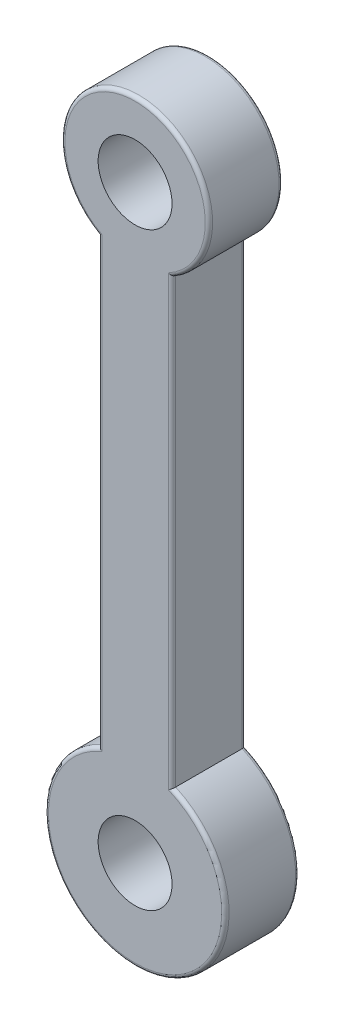
ISO-10303-21;
HEADER;
FILE_DESCRIPTION(('STEP AP214'),'2;1');
FILE_NAME('part.step','',(''),(''),'','','');
FILE_SCHEMA(('AUTOMOTIVE_DESIGN { 1 0 10303 214 1 1 1 1 }'));
ENDSEC;
DATA;
#1=APPLICATION_CONTEXT('core data for automotive mechanical design processes');
#2=APPLICATION_PROTOCOL_DEFINITION('international standard','automotive_design',2000,#1);
#3=PRODUCT_CONTEXT('',#1,'mechanical');
#4=PRODUCT('Part','Part','',(#3));
#5=PRODUCT_RELATED_PRODUCT_CATEGORY('part','',(#4));
#6=PRODUCT_DEFINITION_FORMATION('','',#4);
#7=PRODUCT_DEFINITION_CONTEXT('part definition',#1,'design');
#8=PRODUCT_DEFINITION('design','',#6,#7);
#9=PRODUCT_DEFINITION_SHAPE('','',#8);
#10=(LENGTH_UNIT() NAMED_UNIT(*) SI_UNIT(.MILLI.,.METRE.));
#11=(NAMED_UNIT(*) PLANE_ANGLE_UNIT() SI_UNIT($,.RADIAN.));
#12=(NAMED_UNIT(*) SI_UNIT($,.STERADIAN.) SOLID_ANGLE_UNIT());
#13=UNCERTAINTY_MEASURE_WITH_UNIT(LENGTH_MEASURE(1.E-05),#10,'distance_accuracy_value','');
#14=(GEOMETRIC_REPRESENTATION_CONTEXT(3) GLOBAL_UNCERTAINTY_ASSIGNED_CONTEXT((#13)) GLOBAL_UNIT_ASSIGNED_CONTEXT((#10,
#11,#12)) REPRESENTATION_CONTEXT('',''));
#15=CARTESIAN_POINT('',(0.,0.,0.));
#16=DIRECTION('',(0.,0.,1.));
#17=DIRECTION('',(1.,0.,0.));
#18=AXIS2_PLACEMENT_3D('',#15,#16,#17);
#19=CARTESIAN_POINT('',(0.,0.,20.));
#20=DIRECTION('',(0.,0.,1.));
#21=DIRECTION('',(1.,0.,0.));
#22=AXIS2_PLACEMENT_3D('',#19,#20,#21);
#23=PLANE('',#22);
#24=DIRECTION('',(0.,-1.,0.));
#25=VECTOR('',#24,1.);
#26=CARTESIAN_POINT('',(-9.,-137.320508075689,20.));
#27=LINE('',#26,#25);
#28=CARTESIAN_POINT('',(-9.,-16.7332005306815,20.));
#29=VERTEX_POINT('',#28);
#30=CARTESIAN_POINT('',(-9.,-137.977945776719,20.));
#31=VERTEX_POINT('',#30);
#32=EDGE_CURVE('E132',#29,#31,#27,.T.);
#33=ORIENTED_EDGE('',*,*,#32,.T.);
#34=CARTESIAN_POINT('',(0.,-159.641016151378,20.));
#35=DIRECTION('',(0.,0.,1.));
#36=DIRECTION('',(1.,0.,0.));
#37=AXIS2_PLACEMENT_3D('',#34,#35,#36);
#38=CIRCLE('',#37,23.4582313497294);
#39=CARTESIAN_POINT('',(9.,-137.977945776719,20.));
#40=VERTEX_POINT('',#39);
#41=EDGE_CURVE('E113',#31,#40,#38,.T.);
#42=ORIENTED_EDGE('',*,*,#41,.T.);
#43=DIRECTION('',(0.,1.,0.));
#44=VECTOR('',#43,1.);
#45=CARTESIAN_POINT('',(9.,-17.3205080756888,20.));
#46=LINE('',#45,#44);
#47=CARTESIAN_POINT('',(9.,-16.7332005306815,20.));
#48=VERTEX_POINT('',#47);
#49=EDGE_CURVE('E121',#40,#48,#46,.T.);
#50=ORIENTED_EDGE('',*,*,#49,.T.);
#51=CARTESIAN_POINT('',(0.,0.,20.));
#52=DIRECTION('',(0.,0.,1.));
#53=DIRECTION('',(1.,0.,0.));
#54=AXIS2_PLACEMENT_3D('',#51,#52,#53);
#55=CIRCLE('',#54,19.);
#56=EDGE_CURVE('E127',#48,#29,#55,.T.);
#57=ORIENTED_EDGE('',*,*,#56,.T.);
#58=EDGE_LOOP('',(#33,#42,#50,#57));
#59=FACE_BOUND('',#58,.T.);
#60=CARTESIAN_POINT('',(0.,0.,20.));
#61=DIRECTION('',(0.,0.,1.));
#62=DIRECTION('',(1.,0.,0.));
#63=AXIS2_PLACEMENT_3D('',#60,#61,#62);
#64=CIRCLE('',#63,10.);
#65=CARTESIAN_POINT('',(10.,0.,20.));
#66=VERTEX_POINT('',#65);
#67=EDGE_CURVE('E249',#66,#66,#64,.T.);
#68=ORIENTED_EDGE('',*,*,#67,.F.);
#69=EDGE_LOOP('',(#68));
#70=FACE_BOUND('',#69,.T.);
#71=CARTESIAN_POINT('',(0.,-159.641016151378,20.));
#72=DIRECTION('',(0.,0.,1.));
#73=DIRECTION('',(1.,0.,0.));
#74=AXIS2_PLACEMENT_3D('',#71,#72,#73);
#75=CIRCLE('',#74,10.);
#76=CARTESIAN_POINT('',(10.,-159.641016151378,20.));
#77=VERTEX_POINT('',#76);
#78=EDGE_CURVE('E299',#77,#77,#75,.T.);
#79=ORIENTED_EDGE('',*,*,#78,.F.);
#80=EDGE_LOOP('',(#79));
#81=FACE_BOUND('',#80,.T.);
#82=ADVANCED_FACE('F36',(#59,#70,#81),#23,.T.);
#83=CARTESIAN_POINT('',(0.,0.,0.));
#84=DIRECTION('',(0.,0.,1.));
#85=DIRECTION('',(1.,0.,0.));
#86=AXIS2_PLACEMENT_3D('',#83,#84,#85);
#87=PLANE('',#86);
#88=CARTESIAN_POINT('',(0.,0.,0.));
#89=DIRECTION('',(0.,0.,1.));
#90=DIRECTION('',(1.,0.,0.));
#91=AXIS2_PLACEMENT_3D('',#88,#89,#90);
#92=CIRCLE('',#91,19.);
#93=CARTESIAN_POINT('',(-9.,-16.7332005306815,0.));
#94=VERTEX_POINT('',#93);
#95=CARTESIAN_POINT('',(9.,-16.7332005306815,0.));
#96=VERTEX_POINT('',#95);
#97=EDGE_CURVE('E154',#94,#96,#92,.F.);
#98=ORIENTED_EDGE('',*,*,#97,.T.);
#99=DIRECTION('',(0.,1.,0.));
#100=VECTOR('',#99,1.);
#101=CARTESIAN_POINT('',(9.,0.,0.));
#102=LINE('',#101,#100);
#103=CARTESIAN_POINT('',(9.,-137.977945776719,0.));
#104=VERTEX_POINT('',#103);
#105=EDGE_CURVE('E11',#96,#104,#102,.F.);
#106=ORIENTED_EDGE('',*,*,#105,.T.);
#107=CARTESIAN_POINT('',(0.,-159.641016151378,0.));
#108=DIRECTION('',(0.,0.,1.));
#109=DIRECTION('',(1.,0.,0.));
#110=AXIS2_PLACEMENT_3D('',#107,#108,#109);
#111=CIRCLE('',#110,23.4582313497294);
#112=CARTESIAN_POINT('',(-9.,-137.977945776719,0.));
#113=VERTEX_POINT('',#112);
#114=EDGE_CURVE('E50',#104,#113,#111,.F.);
#115=ORIENTED_EDGE('',*,*,#114,.T.);
#116=DIRECTION('',(0.,-1.,0.));
#117=VECTOR('',#116,1.);
#118=CARTESIAN_POINT('',(-9.,0.,0.));
#119=LINE('',#118,#117);
#120=EDGE_CURVE('E156',#113,#94,#119,.F.);
#121=ORIENTED_EDGE('',*,*,#120,.T.);
#122=EDGE_LOOP('',(#98,#106,#115,#121));
#123=FACE_BOUND('',#122,.T.);
#124=CARTESIAN_POINT('',(0.,0.,0.));
#125=DIRECTION('',(0.,0.,1.));
#126=DIRECTION('',(1.,0.,0.));
#127=AXIS2_PLACEMENT_3D('',#124,#125,#126);
#128=CIRCLE('',#127,10.);
#129=CARTESIAN_POINT('',(10.,0.,0.));
#130=VERTEX_POINT('',#129);
#131=EDGE_CURVE('E254',#130,#130,#128,.T.);
#132=ORIENTED_EDGE('',*,*,#131,.T.);
#133=EDGE_LOOP('',(#132));
#134=FACE_BOUND('',#133,.T.);
#135=CARTESIAN_POINT('',(0.,-159.641016151378,0.));
#136=DIRECTION('',(0.,0.,1.));
#137=DIRECTION('',(1.,0.,0.));
#138=AXIS2_PLACEMENT_3D('',#135,#136,#137);
#139=CIRCLE('',#138,10.);
#140=CARTESIAN_POINT('',(10.,-159.641016151378,0.));
#141=VERTEX_POINT('',#140);
#142=EDGE_CURVE('E193',#141,#141,#139,.T.);
#143=ORIENTED_EDGE('',*,*,#142,.T.);
#144=EDGE_LOOP('',(#143));
#145=FACE_BOUND('',#144,.T.);
#146=ADVANCED_FACE('F233',(#123,#134,#145),#87,.F.);
#147=CARTESIAN_POINT('',(0.,0.,20.));
#148=DIRECTION('',(0.,0.,-1.));
#149=DIRECTION('',(-1.,0.,0.));
#150=AXIS2_PLACEMENT_3D('',#147,#148,#149);
#151=CYLINDRICAL_SURFACE('',#150,20.);
#152=DIRECTION('',(0.,0.,-1.));
#153=VECTOR('',#152,1.);
#154=CARTESIAN_POINT('',(-10.,-17.3205080756888,20.));
#155=LINE('',#154,#153);
#156=CARTESIAN_POINT('',(-10.,-17.3205080756888,19.));
#157=VERTEX_POINT('',#156);
#158=CARTESIAN_POINT('',(-10.,-17.3205080756888,0.999999999999997));
#159=VERTEX_POINT('',#158);
#160=EDGE_CURVE('E128',#157,#159,#155,.T.);
#161=ORIENTED_EDGE('',*,*,#160,.F.);
#162=CARTESIAN_POINT('',(0.,0.,19.));
#163=DIRECTION('',(0.,0.,1.));
#164=DIRECTION('',(1.,0.,0.));
#165=AXIS2_PLACEMENT_3D('',#162,#163,#164);
#166=CIRCLE('',#165,20.);
#167=CARTESIAN_POINT('',(10.,-17.3205080756888,19.));
#168=VERTEX_POINT('',#167);
#169=EDGE_CURVE('E147',#157,#168,#166,.F.);
#170=ORIENTED_EDGE('',*,*,#169,.T.);
#171=DIRECTION('',(0.,0.,-1.));
#172=VECTOR('',#171,1.);
#173=CARTESIAN_POINT('',(10.,-17.3205080756888,20.));
#174=LINE('',#173,#172);
#175=CARTESIAN_POINT('',(10.,-17.3205080756888,0.999999999999997));
#176=VERTEX_POINT('',#175);
#177=EDGE_CURVE('E244',#168,#176,#174,.T.);
#178=ORIENTED_EDGE('',*,*,#177,.T.);
#179=CARTESIAN_POINT('',(0.,0.,1.));
#180=DIRECTION('',(0.,0.,1.));
#181=DIRECTION('',(1.,0.,0.));
#182=AXIS2_PLACEMENT_3D('',#179,#180,#181);
#183=CIRCLE('',#182,20.);
#184=EDGE_CURVE('E145',#176,#159,#183,.T.);
#185=ORIENTED_EDGE('',*,*,#184,.T.);
#186=EDGE_LOOP('',(#161,#170,#178,#185));
#187=FACE_BOUND('',#186,.T.);
#188=ADVANCED_FACE('F247',(#187),#151,.T.);
#189=CARTESIAN_POINT('',(-10.,-17.3205080756888,20.));
#190=DIRECTION('',(1.,0.,0.));
#191=DIRECTION('',(0.,0.,-1.));
#192=AXIS2_PLACEMENT_3D('',#189,#190,#191);
#193=PLANE('',#192);
#194=DIRECTION('',(0.,0.,-1.));
#195=VECTOR('',#194,1.);
#196=CARTESIAN_POINT('',(-10.,-137.320508075689,20.));
#197=LINE('',#196,#195);
#198=CARTESIAN_POINT('',(-10.,-137.320508075689,19.));
#199=VERTEX_POINT('',#198);
#200=CARTESIAN_POINT('',(-10.,-137.320508075689,0.999999999999997));
#201=VERTEX_POINT('',#200);
#202=EDGE_CURVE('E251',#199,#201,#197,.T.);
#203=ORIENTED_EDGE('',*,*,#202,.F.);
#204=DIRECTION('',(0.,-1.,0.));
#205=VECTOR('',#204,1.);
#206=CARTESIAN_POINT('',(-10.,-17.3205080756888,19.));
#207=LINE('',#206,#205);
#208=EDGE_CURVE('E143',#199,#157,#207,.F.);
#209=ORIENTED_EDGE('',*,*,#208,.T.);
#210=ORIENTED_EDGE('',*,*,#160,.T.);
#211=DIRECTION('',(0.,-1.,0.));
#212=VECTOR('',#211,1.);
#213=CARTESIAN_POINT('',(-10.,-17.3205080756888,1.));
#214=LINE('',#213,#212);
#215=EDGE_CURVE('E141',#159,#201,#214,.T.);
#216=ORIENTED_EDGE('',*,*,#215,.T.);
#217=EDGE_LOOP('',(#203,#209,#210,#216));
#218=FACE_BOUND('',#217,.T.);
#219=ADVANCED_FACE('F267',(#218),#193,.F.);
#220=CARTESIAN_POINT('',(0.,-159.641016151378,20.));
#221=DIRECTION('',(0.,0.,-1.));
#222=DIRECTION('',(-1.,0.,0.));
#223=AXIS2_PLACEMENT_3D('',#220,#221,#222);
#224=CYLINDRICAL_SURFACE('',#223,24.4582313497294);
#225=DIRECTION('',(0.,0.,-1.));
#226=VECTOR('',#225,1.);
#227=CARTESIAN_POINT('',(10.,-137.320508075689,20.));
#228=LINE('',#227,#226);
#229=CARTESIAN_POINT('',(10.,-137.320508075689,19.));
#230=VERTEX_POINT('',#229);
#231=CARTESIAN_POINT('',(10.,-137.320508075689,0.999999999999997));
#232=VERTEX_POINT('',#231);
#233=EDGE_CURVE('E246',#230,#232,#228,.T.);
#234=ORIENTED_EDGE('',*,*,#233,.F.);
#235=CARTESIAN_POINT('',(0.,-159.641016151378,19.));
#236=DIRECTION('',(0.,0.,1.));
#237=DIRECTION('',(1.,0.,0.));
#238=AXIS2_PLACEMENT_3D('',#235,#236,#237);
#239=CIRCLE('',#238,24.4582313497294);
#240=EDGE_CURVE('E115',#230,#199,#239,.F.);
#241=ORIENTED_EDGE('',*,*,#240,.T.);
#242=ORIENTED_EDGE('',*,*,#202,.T.);
#243=CARTESIAN_POINT('',(0.,-159.641016151378,1.));
#244=DIRECTION('',(0.,0.,1.));
#245=DIRECTION('',(1.,0.,0.));
#246=AXIS2_PLACEMENT_3D('',#243,#244,#245);
#247=CIRCLE('',#246,24.4582313497294);
#248=EDGE_CURVE('E134',#201,#232,#247,.T.);
#249=ORIENTED_EDGE('',*,*,#248,.T.);
#250=EDGE_LOOP('',(#234,#241,#242,#249));
#251=FACE_BOUND('',#250,.T.);
#252=ADVANCED_FACE('F266',(#251),#224,.T.);
#253=CARTESIAN_POINT('',(10.,-17.3205080756888,20.));
#254=DIRECTION('',(-1.,0.,0.));
#255=DIRECTION('',(0.,0.,1.));
#256=AXIS2_PLACEMENT_3D('',#253,#254,#255);
#257=PLANE('',#256);
#258=ORIENTED_EDGE('',*,*,#177,.F.);
#259=DIRECTION('',(0.,1.,0.));
#260=VECTOR('',#259,1.);
#261=CARTESIAN_POINT('',(10.,-137.320508075689,19.));
#262=LINE('',#261,#260);
#263=EDGE_CURVE('E152',#168,#230,#262,.F.);
#264=ORIENTED_EDGE('',*,*,#263,.T.);
#265=ORIENTED_EDGE('',*,*,#233,.T.);
#266=DIRECTION('',(0.,1.,0.));
#267=VECTOR('',#266,1.);
#268=CARTESIAN_POINT('',(10.,-17.3205080756888,1.));
#269=LINE('',#268,#267);
#270=EDGE_CURVE('E149',#232,#176,#269,.T.);
#271=ORIENTED_EDGE('',*,*,#270,.T.);
#272=EDGE_LOOP('',(#258,#264,#265,#271));
#273=FACE_BOUND('',#272,.T.);
#274=ADVANCED_FACE('F243',(#273),#257,.F.);
#275=CARTESIAN_POINT('',(0.,0.,20.));
#276=DIRECTION('',(0.,0.,-1.));
#277=DIRECTION('',(-1.,0.,0.));
#278=AXIS2_PLACEMENT_3D('',#275,#276,#277);
#279=CYLINDRICAL_SURFACE('',#278,10.);
#280=ORIENTED_EDGE('',*,*,#67,.T.);
#281=EDGE_LOOP('',(#280));
#282=FACE_BOUND('',#281,.T.);
#283=ORIENTED_EDGE('',*,*,#131,.F.);
#284=EDGE_LOOP('',(#283));
#285=FACE_BOUND('',#284,.T.);
#286=ADVANCED_FACE('F282',(#282,#285),#279,.F.);
#287=CARTESIAN_POINT('',(0.,-159.641016151378,20.));
#288=DIRECTION('',(0.,0.,-1.));
#289=DIRECTION('',(-1.,0.,0.));
#290=AXIS2_PLACEMENT_3D('',#287,#288,#289);
#291=CYLINDRICAL_SURFACE('',#290,10.);
#292=ORIENTED_EDGE('',*,*,#78,.T.);
#293=EDGE_LOOP('',(#292));
#294=FACE_BOUND('',#293,.T.);
#295=ORIENTED_EDGE('',*,*,#142,.F.);
#296=EDGE_LOOP('',(#295));
#297=FACE_BOUND('',#296,.T.);
#298=ADVANCED_FACE('F289',(#294,#297),#291,.F.);
#299=CARTESIAN_POINT('',(0.,0.,19.));
#300=DIRECTION('',(0.,0.,1.));
#301=DIRECTION('',(1.,0.,0.));
#302=AXIS2_PLACEMENT_3D('',#299,#300,#301);
#303=TOROIDAL_SURFACE('',#302,19.,1.);
#304=CARTESIAN_POINT('',(10.,-17.3205080756888,19.));
#305=CARTESIAN_POINT('',(10.0000015213787,-17.3205088649879,19.0254213694073));
#306=CARTESIAN_POINT('',(9.9990298908973,-17.3199479917732,19.0508294576426));
#307=CARTESIAN_POINT('',(9.99516504436778,-17.3177164417791,19.1014418799058));
#308=CARTESIAN_POINT('',(9.99227245124936,-17.3160461247702,19.1266462773057));
#309=CARTESIAN_POINT('',(9.98078809503932,-17.3094131179025,19.2014605330454));
#310=CARTESIAN_POINT('',(9.96938918157886,-17.3028280552472,19.2505313542434));
#311=CARTESIAN_POINT('',(9.93967240320598,-17.2856449291653,19.3456933166742));
#312=CARTESIAN_POINT('',(9.92136026994311,-17.2750501900846,19.391786889327));
#313=CARTESIAN_POINT('',(9.87861920031722,-17.2502909209951,19.480035288383));
#314=CARTESIAN_POINT('',(9.85418534373633,-17.2361235194671,19.5221869089135));
#315=CARTESIAN_POINT('',(9.79876970962982,-17.2039433022038,19.6037551827543));
#316=CARTESIAN_POINT('',(9.76751932861995,-17.1857722779364,19.6429258012997));
#317=CARTESIAN_POINT('',(9.70039220690246,-17.1466680871438,19.7154687382402));
#318=CARTESIAN_POINT('',(9.66451432931181,-17.1257342418196,19.7488396270128));
#319=CARTESIAN_POINT('',(9.58435755500454,-17.0788689993086,19.8133244345145));
#320=CARTESIAN_POINT('',(9.53959033522715,-17.0526405245776,19.8436145075656));
#321=CARTESIAN_POINT('',(9.44673922114586,-16.9981037001412,19.8962573307227));
#322=CARTESIAN_POINT('',(9.39865179544903,-16.9697931337577,19.9186014692109));
#323=CARTESIAN_POINT('',(9.2939250511975,-16.9079737334143,19.9576672613025));
#324=CARTESIAN_POINT('',(9.23698803401073,-16.8742683233141,19.9732764258468));
#325=CARTESIAN_POINT('',(9.12192232680775,-16.8059397288755,19.9942558815965));
#326=CARTESIAN_POINT('',(9.0637963634934,-16.7713186005823,19.999647414163));
#327=CARTESIAN_POINT('',(9.00385664538732,-16.7355051991757,19.9999944308194));
#328=CARTESIAN_POINT('',(9.00192824516759,-16.7343528787191,20.0000000085153));
#329=CARTESIAN_POINT('',(9.,-16.7332005306815,20.));
#330=B_SPLINE_CURVE_WITH_KNOTS('',3,(#304,#305,#306,#307,#308,#309,#310,#311,#312,#313,#314,
#315,#316,#317,#318,#319,#320,#321,#322,#323,#324,#325,#326,#327,#328,#329),.UNSPECIFIED.,.F.,
.F.,(4,2,2,2,2,2,2,2,2,2,2,2,4),(0.,0.0762135177415197,0.1524023330285,0.304010944443037,
0.455494134438775,0.607099468929364,0.766370013796125,0.925679763039859,1.10520657890246,
1.28492737298502,1.48807392731624,1.69079769648834,1.69753705604942),.UNSPECIFIED.);
#331=EDGE_CURVE('E124',#168,#48,#330,.T.);
#332=ORIENTED_EDGE('',*,*,#331,.F.);
#333=ORIENTED_EDGE('',*,*,#169,.F.);
#334=CARTESIAN_POINT('',(-10.,-17.3205080756888,19.));
#335=CARTESIAN_POINT('',(-10.0000015213787,-17.3205088649879,19.0254213694073));
#336=CARTESIAN_POINT('',(-9.9990298908973,-17.3199479917732,19.0508294576426));
#337=CARTESIAN_POINT('',(-9.99516504436778,-17.3177164417791,19.1014418799058));
#338=CARTESIAN_POINT('',(-9.99227245124936,-17.3160461247702,19.1266462773057));
#339=CARTESIAN_POINT('',(-9.98078809503932,-17.3094131179025,19.2014605330454));
#340=CARTESIAN_POINT('',(-9.96938918157886,-17.3028280552472,19.2505313542434));
#341=CARTESIAN_POINT('',(-9.93967240320598,-17.2856449291653,19.3456933166742));
#342=CARTESIAN_POINT('',(-9.92136026994311,-17.2750501900846,19.391786889327));
#343=CARTESIAN_POINT('',(-9.87861920031722,-17.2502909209951,19.480035288383));
#344=CARTESIAN_POINT('',(-9.85418534373633,-17.2361235194671,19.5221869089135));
#345=CARTESIAN_POINT('',(-9.79876970962982,-17.2039433022038,19.6037551827543));
#346=CARTESIAN_POINT('',(-9.76751932861995,-17.1857722779364,19.6429258012997));
#347=CARTESIAN_POINT('',(-9.70039220690246,-17.1466680871438,19.7154687382402));
#348=CARTESIAN_POINT('',(-9.66451432931181,-17.1257342418196,19.7488396270128));
#349=CARTESIAN_POINT('',(-9.58435755500454,-17.0788689993086,19.8133244345145));
#350=CARTESIAN_POINT('',(-9.53959033522715,-17.0526405245776,19.8436145075656));
#351=CARTESIAN_POINT('',(-9.44673922114586,-16.9981037001412,19.8962573307227));
#352=CARTESIAN_POINT('',(-9.39865179544903,-16.9697931337577,19.9186014692109));
#353=CARTESIAN_POINT('',(-9.2939250511975,-16.9079737334143,19.9576672613025));
#354=CARTESIAN_POINT('',(-9.23698803401073,-16.8742683233141,19.9732764258468));
#355=CARTESIAN_POINT('',(-9.12192232680775,-16.8059397288755,19.9942558815965));
#356=CARTESIAN_POINT('',(-9.0637963634934,-16.7713186005823,19.999647414163));
#357=CARTESIAN_POINT('',(-9.00385664538732,-16.7355051991757,19.9999944308194));
#358=CARTESIAN_POINT('',(-9.00192824516759,-16.7343528787191,20.0000000085153));
#359=CARTESIAN_POINT('',(-9.,-16.7332005306815,20.));
#360=B_SPLINE_CURVE_WITH_KNOTS('',3,(#334,#335,#336,#337,#338,#339,#340,#341,#342,#343,#344,
#345,#346,#347,#348,#349,#350,#351,#352,#353,#354,#355,#356,#357,#358,#359),.UNSPECIFIED.,.F.,
.F.,(4,2,2,2,2,2,2,2,2,2,2,2,4),(0.,0.0762135177415197,0.1524023330285,0.304010944443037,
0.455494134438775,0.607099468929364,0.766370013796125,0.925679763039859,1.10520657890246,
1.28492737298502,1.48807392731624,1.69079769648834,1.69753705604942),.UNSPECIFIED.);
#361=EDGE_CURVE('E186',#29,#157,#360,.F.);
#362=ORIENTED_EDGE('',*,*,#361,.F.);
#363=ORIENTED_EDGE('',*,*,#56,.F.);
#364=EDGE_LOOP('',(#332,#333,#362,#363));
#365=FACE_BOUND('',#364,.T.);
#366=ADVANCED_FACE('F180',(#365),#303,.T.);
#367=CARTESIAN_POINT('',(-9.,0.,19.));
#368=DIRECTION('',(0.,1.,0.));
#369=DIRECTION('',(0.,0.,1.));
#370=AXIS2_PLACEMENT_3D('',#367,#368,#369);
#371=CYLINDRICAL_SURFACE('',#370,1.);
#372=ORIENTED_EDGE('',*,*,#361,.T.);
#373=ORIENTED_EDGE('',*,*,#208,.F.);
#374=CARTESIAN_POINT('',(-10.,-137.320508075689,19.));
#375=CARTESIAN_POINT('',(-10.000001799882,-137.320506990151,19.0248989787468));
#376=CARTESIAN_POINT('',(-9.99906932875468,-137.321110915363,19.0497846506509));
#377=CARTESIAN_POINT('',(-9.99536255969989,-137.323512156469,19.0993510007927));
#378=CARTESIAN_POINT('',(-9.99258897458729,-137.325309010503,19.1240317546246));
#379=CARTESIAN_POINT('',(-9.98158756030443,-137.332437491123,19.1972482859384));
#380=CARTESIAN_POINT('',(-9.97067837246651,-137.339507475066,19.2452465898575));
#381=CARTESIAN_POINT('',(-9.9423006680479,-137.357912612567,19.3382867689851));
#382=CARTESIAN_POINT('',(-9.92483943650304,-137.369243029098,19.3833318626821));
#383=CARTESIAN_POINT('',(-9.88417043991277,-137.395659924502,19.4695944364561));
#384=CARTESIAN_POINT('',(-9.86095687802403,-137.410750192407,19.5108079973811));
#385=CARTESIAN_POINT('',(-9.8082018710006,-137.445087061797,19.590970888278));
#386=CARTESIAN_POINT('',(-9.77836837489967,-137.464526034869,19.6296441312941));
#387=CARTESIAN_POINT('',(-9.71437338393335,-137.506287654426,19.7014163641255));
#388=CARTESIAN_POINT('',(-9.68021100848484,-137.528610887647,19.7345142165918));
#389=CARTESIAN_POINT('',(-9.60305227596163,-137.579114920227,19.7995282074503));
#390=CARTESIAN_POINT('',(-9.55950296480376,-137.607670000007,19.8304962618502));
#391=CARTESIAN_POINT('',(-9.4691764770102,-137.667021850803,19.884676795614));
#392=CARTESIAN_POINT('',(-9.42239508009534,-137.697821555717,19.9078788945732));
#393=CARTESIAN_POINT('',(-9.31507996941294,-137.76863281799,19.9512306349366));
#394=CARTESIAN_POINT('',(-9.25396781101131,-137.809063539766,19.969266916028));
#395=CARTESIAN_POINT('',(-9.13034756235588,-137.89108543345,19.993461216682));
#396=CARTESIAN_POINT('',(-9.0678425801236,-137.932674064952,19.9996434358544));
#397=CARTESIAN_POINT('',(-9.00364940973964,-137.975510212138,19.9999950105091));
#398=CARTESIAN_POINT('',(-9.00182463514341,-137.976727989075,20.0000000046921));
#399=CARTESIAN_POINT('',(-9.,-137.977945776719,20.));
#400=B_SPLINE_CURVE_WITH_KNOTS('',3,(#374,#375,#376,#377,#378,#379,#380,#381,#382,#383,#384,
#385,#386,#387,#388,#389,#390,#391,#392,#393,#394,#395,#396,#397,#398,#399),.UNSPECIFIED.,.F.,
.F.,(4,2,2,2,2,2,2,2,2,2,2,2,4),(0.,0.0746463806174724,0.149263877612207,0.297646167358094,
0.445863961473959,0.594231732124319,0.751333054340347,0.908466385655165,1.08953662851611,
1.27084794222994,1.4962375452077,1.72116653207475,1.72774793907547),.UNSPECIFIED.);
#401=EDGE_CURVE('E118',#31,#199,#400,.F.);
#402=ORIENTED_EDGE('',*,*,#401,.F.);
#403=ORIENTED_EDGE('',*,*,#32,.F.);
#404=EDGE_LOOP('',(#372,#373,#402,#403));
#405=FACE_BOUND('',#404,.T.);
#406=ADVANCED_FACE('F175',(#405),#371,.T.);
#407=CARTESIAN_POINT('',(9.,0.,19.));
#408=DIRECTION('',(0.,-1.,0.));
#409=DIRECTION('',(0.,0.,-1.));
#410=AXIS2_PLACEMENT_3D('',#407,#408,#409);
#411=CYLINDRICAL_SURFACE('',#410,1.);
#412=ORIENTED_EDGE('',*,*,#331,.T.);
#413=ORIENTED_EDGE('',*,*,#49,.F.);
#414=CARTESIAN_POINT('',(10.,-137.320508075689,19.));
#415=CARTESIAN_POINT('',(10.000001799882,-137.320506990151,19.0248989787468));
#416=CARTESIAN_POINT('',(9.99906932875468,-137.321110915363,19.0497846506509));
#417=CARTESIAN_POINT('',(9.99536255969989,-137.323512156469,19.0993510007927));
#418=CARTESIAN_POINT('',(9.99258897458729,-137.325309010503,19.1240317546246));
#419=CARTESIAN_POINT('',(9.98158756030443,-137.332437491123,19.1972482859384));
#420=CARTESIAN_POINT('',(9.97067837246651,-137.339507475066,19.2452465898575));
#421=CARTESIAN_POINT('',(9.9423006680479,-137.357912612567,19.3382867689851));
#422=CARTESIAN_POINT('',(9.92483943650304,-137.369243029098,19.3833318626821));
#423=CARTESIAN_POINT('',(9.88417043991277,-137.395659924502,19.4695944364561));
#424=CARTESIAN_POINT('',(9.86095687802403,-137.410750192407,19.5108079973811));
#425=CARTESIAN_POINT('',(9.8082018710006,-137.445087061797,19.590970888278));
#426=CARTESIAN_POINT('',(9.77836837489967,-137.464526034869,19.6296441312941));
#427=CARTESIAN_POINT('',(9.71437338393335,-137.506287654426,19.7014163641255));
#428=CARTESIAN_POINT('',(9.68021100848484,-137.528610887647,19.7345142165918));
#429=CARTESIAN_POINT('',(9.60305227596163,-137.579114920227,19.7995282074503));
#430=CARTESIAN_POINT('',(9.55950296480376,-137.607670000007,19.8304962618502));
#431=CARTESIAN_POINT('',(9.46917647701019,-137.667021850803,19.884676795614));
#432=CARTESIAN_POINT('',(9.42239508009533,-137.697821555717,19.9078788945732));
#433=CARTESIAN_POINT('',(9.31507996941294,-137.76863281799,19.9512306349366));
#434=CARTESIAN_POINT('',(9.25396781101131,-137.809063539766,19.969266916028));
#435=CARTESIAN_POINT('',(9.13034756235588,-137.89108543345,19.993461216682));
#436=CARTESIAN_POINT('',(9.0678425801236,-137.932674064952,19.9996434358544));
#437=CARTESIAN_POINT('',(9.00364940973964,-137.975510212138,19.9999950105091));
#438=CARTESIAN_POINT('',(9.00182463514341,-137.976727989075,20.0000000046921));
#439=CARTESIAN_POINT('',(9.,-137.977945776719,20.));
#440=B_SPLINE_CURVE_WITH_KNOTS('',3,(#414,#415,#416,#417,#418,#419,#420,#421,#422,#423,#424,
#425,#426,#427,#428,#429,#430,#431,#432,#433,#434,#435,#436,#437,#438,#439),.UNSPECIFIED.,.F.,
.F.,(4,2,2,2,2,2,2,2,2,2,2,2,4),(0.,0.074646380617469,0.149263877612207,0.297646167358094,
0.445863961473959,0.594231732124319,0.751333054340348,0.908466385655165,1.08953662851612,
1.27084794222994,1.4962375452077,1.72116653207475,1.72774793907547),.UNSPECIFIED.);
#441=EDGE_CURVE('E109',#230,#40,#440,.T.);
#442=ORIENTED_EDGE('',*,*,#441,.F.);
#443=ORIENTED_EDGE('',*,*,#263,.F.);
#444=EDGE_LOOP('',(#412,#413,#442,#443));
#445=FACE_BOUND('',#444,.T.);
#446=ADVANCED_FACE('F122',(#445),#411,.T.);
#447=CARTESIAN_POINT('',(0.,-159.641016151378,19.));
#448=DIRECTION('',(0.,0.,1.));
#449=DIRECTION('',(1.,0.,0.));
#450=AXIS2_PLACEMENT_3D('',#447,#448,#449);
#451=TOROIDAL_SURFACE('',#450,23.4582313497294,1.);
#452=ORIENTED_EDGE('',*,*,#401,.T.);
#453=ORIENTED_EDGE('',*,*,#240,.F.);
#454=ORIENTED_EDGE('',*,*,#441,.T.);
#455=ORIENTED_EDGE('',*,*,#41,.F.);
#456=EDGE_LOOP('',(#452,#453,#454,#455));
#457=FACE_BOUND('',#456,.T.);
#458=ADVANCED_FACE('F111',(#457),#451,.T.);
#459=CARTESIAN_POINT('',(-9.,-17.3205080756888,1.));
#460=DIRECTION('',(0.,-1.,0.));
#461=DIRECTION('',(0.,0.,-1.));
#462=AXIS2_PLACEMENT_3D('',#459,#460,#461);
#463=CYLINDRICAL_SURFACE('',#462,1.);
#464=CARTESIAN_POINT('',(-10.,-17.3205080756888,0.999999999999997));
#465=CARTESIAN_POINT('',(-10.0000015213787,-17.3205088649879,0.974578630592668));
#466=CARTESIAN_POINT('',(-9.9990298908973,-17.3199479917732,0.949170542357406));
#467=CARTESIAN_POINT('',(-9.99516504436778,-17.3177164417791,0.898558120094177));
#468=CARTESIAN_POINT('',(-9.99227245124936,-17.3160461247702,0.873353722694295));
#469=CARTESIAN_POINT('',(-9.98078809503932,-17.3094131179025,0.798539466954644));
#470=CARTESIAN_POINT('',(-9.96938918157886,-17.3028280552472,0.749468645756606));
#471=CARTESIAN_POINT('',(-9.93967240320598,-17.2856449291653,0.654306683325831));
#472=CARTESIAN_POINT('',(-9.92136026994311,-17.2750501900846,0.60821311067301));
#473=CARTESIAN_POINT('',(-9.87861920031722,-17.2502909209951,0.519964711616969));
#474=CARTESIAN_POINT('',(-9.85418534373633,-17.2361235194671,0.477813091086526));
#475=CARTESIAN_POINT('',(-9.79876970962982,-17.2039433022038,0.396244817245725));
#476=CARTESIAN_POINT('',(-9.76751932861995,-17.1857722779364,0.357074198700323));
#477=CARTESIAN_POINT('',(-9.70039220690246,-17.1466680871438,0.284531261759825));
#478=CARTESIAN_POINT('',(-9.66451432931181,-17.1257342418196,0.251160372987181));
#479=CARTESIAN_POINT('',(-9.58435755500453,-17.0788689993086,0.186675565485452));
#480=CARTESIAN_POINT('',(-9.53959033522714,-17.0526405245776,0.156385492434427));
#481=CARTESIAN_POINT('',(-9.44673922114586,-16.9981037001412,0.103742669277256));
#482=CARTESIAN_POINT('',(-9.39865179544903,-16.9697931337577,0.0813985307891217));
#483=CARTESIAN_POINT('',(-9.2939250511975,-16.9079737334143,0.0423327386974863));
#484=CARTESIAN_POINT('',(-9.23698803401073,-16.8742683233141,0.0267235741532206));
#485=CARTESIAN_POINT('',(-9.12192232680775,-16.8059397288755,0.00574411840347164));
#486=CARTESIAN_POINT('',(-9.0637963634934,-16.7713186005823,0.000352585836997369));
#487=CARTESIAN_POINT('',(-9.00385664538732,-16.7355051991757,5.56918058794224E-06));
#488=CARTESIAN_POINT('',(-9.00192824516759,-16.7343528787191,-8.51534430952261E-09));
#489=CARTESIAN_POINT('',(-9.,-16.7332005306815,0.));
#490=B_SPLINE_CURVE_WITH_KNOTS('',3,(#464,#465,#466,#467,#468,#469,#470,#471,#472,#473,#474,
#475,#476,#477,#478,#479,#480,#481,#482,#483,#484,#485,#486,#487,#488,#489),.UNSPECIFIED.,.F.,
.F.,(4,2,2,2,2,2,2,2,2,2,2,2,4),(0.,0.0762135177415199,0.152402333028498,0.304010944443036,
0.455494134438775,0.607099468929366,0.766370013796124,0.925679763039861,1.10520657890246,
1.28492737298502,1.48807392731625,1.69079769648834,1.69753705604942),.UNSPECIFIED.);
#491=EDGE_CURVE('E218',#94,#159,#490,.F.);
#492=ORIENTED_EDGE('',*,*,#491,.F.);
#493=ORIENTED_EDGE('',*,*,#120,.F.);
#494=CARTESIAN_POINT('',(-10.,-137.320508075689,0.999999999999997));
#495=CARTESIAN_POINT('',(-10.000001799882,-137.320506990151,0.975101021253209));
#496=CARTESIAN_POINT('',(-9.99906932875468,-137.321110915363,0.950215349349134));
#497=CARTESIAN_POINT('',(-9.99536255969989,-137.323512156469,0.900648999207316));
#498=CARTESIAN_POINT('',(-9.99258897458729,-137.325309010503,0.875968245375389));
#499=CARTESIAN_POINT('',(-9.98158756030443,-137.332437491123,0.802751714061625));
#500=CARTESIAN_POINT('',(-9.97067837246651,-137.339507475066,0.754753410142452));
#501=CARTESIAN_POINT('',(-9.9423006680479,-137.357912612567,0.66171323101486));
#502=CARTESIAN_POINT('',(-9.92483943650304,-137.369243029098,0.616668137317949));
#503=CARTESIAN_POINT('',(-9.88417043991277,-137.395659924502,0.530405563543864));
#504=CARTESIAN_POINT('',(-9.86095687802403,-137.410750192407,0.489192002618903));
#505=CARTESIAN_POINT('',(-9.8082018710006,-137.445087061797,0.409029111722025));
#506=CARTESIAN_POINT('',(-9.77836837489967,-137.464526034869,0.370355868705908));
#507=CARTESIAN_POINT('',(-9.71437338393334,-137.506287654426,0.298583635874449));
#508=CARTESIAN_POINT('',(-9.68021100848483,-137.528610887647,0.265485783408161));
#509=CARTESIAN_POINT('',(-9.60305227596162,-137.579114920227,0.200471792549676));
#510=CARTESIAN_POINT('',(-9.55950296480375,-137.607670000007,0.169503738149814));
#511=CARTESIAN_POINT('',(-9.46917647701019,-137.667021850803,0.115323204386019));
#512=CARTESIAN_POINT('',(-9.42239508009534,-137.697821555717,0.092121105426777));
#513=CARTESIAN_POINT('',(-9.31507996941295,-137.76863281799,0.0487693650634076));
#514=CARTESIAN_POINT('',(-9.25396781101132,-137.809063539766,0.0307330839720454));
#515=CARTESIAN_POINT('',(-9.13034756235589,-137.89108543345,0.00653878331802616));
#516=CARTESIAN_POINT('',(-9.06784258012361,-137.932674064952,0.000356564145599337));
#517=CARTESIAN_POINT('',(-9.00364940973964,-137.975510212138,4.98949090864816E-06));
#518=CARTESIAN_POINT('',(-9.00182463514341,-137.976727989075,-4.6920682636258E-09));
#519=CARTESIAN_POINT('',(-9.,-137.977945776719,0.));
#520=B_SPLINE_CURVE_WITH_KNOTS('',3,(#494,#495,#496,#497,#498,#499,#500,#501,#502,#503,#504,
#505,#506,#507,#508,#509,#510,#511,#512,#513,#514,#515,#516,#517,#518,#519),.UNSPECIFIED.,.F.,
.F.,(4,2,2,2,2,2,2,2,2,2,2,2,4),(0.,0.074646380617468,0.149263877612204,0.297646167358093,
0.445863961473959,0.59423173212432,0.751333054340352,0.908466385655175,1.08953662851612,
1.27084794222994,1.49623754520769,1.72116653207475,1.72774793907547),.UNSPECIFIED.);
#521=EDGE_CURVE('E41',#201,#113,#520,.T.);
#522=ORIENTED_EDGE('',*,*,#521,.F.);
#523=ORIENTED_EDGE('',*,*,#215,.F.);
#524=EDGE_LOOP('',(#492,#493,#522,#523));
#525=FACE_BOUND('',#524,.T.);
#526=ADVANCED_FACE('F38',(#525),#463,.T.);
#527=CARTESIAN_POINT('',(0.,-159.641016151378,1.));
#528=DIRECTION('',(0.,0.,1.));
#529=DIRECTION('',(1.,0.,0.));
#530=AXIS2_PLACEMENT_3D('',#527,#528,#529);
#531=TOROIDAL_SURFACE('',#530,23.4582313497294,1.);
#532=ORIENTED_EDGE('',*,*,#521,.T.);
#533=ORIENTED_EDGE('',*,*,#114,.F.);
#534=CARTESIAN_POINT('',(10.,-137.320508075689,0.999999999999997));
#535=CARTESIAN_POINT('',(10.000001799882,-137.320506990151,0.975101021253209));
#536=CARTESIAN_POINT('',(9.99906932875468,-137.321110915363,0.950215349349134));
#537=CARTESIAN_POINT('',(9.99536255969989,-137.323512156469,0.900648999207316));
#538=CARTESIAN_POINT('',(9.99258897458729,-137.325309010503,0.87596824537539));
#539=CARTESIAN_POINT('',(9.98158756030443,-137.332437491123,0.802751714061625));
#540=CARTESIAN_POINT('',(9.97067837246652,-137.339507475066,0.754753410142453));
#541=CARTESIAN_POINT('',(9.9423006680479,-137.357912612567,0.66171323101486));
#542=CARTESIAN_POINT('',(9.92483943650304,-137.369243029098,0.616668137317949));
#543=CARTESIAN_POINT('',(9.88417043991277,-137.395659924502,0.530405563543864));
#544=CARTESIAN_POINT('',(9.86095687802403,-137.410750192407,0.489192002618903));
#545=CARTESIAN_POINT('',(9.8082018710006,-137.445087061797,0.409029111722025));
#546=CARTESIAN_POINT('',(9.77836837489967,-137.464526034869,0.370355868705909));
#547=CARTESIAN_POINT('',(9.71437338393334,-137.506287654426,0.29858363587445));
#548=CARTESIAN_POINT('',(9.68021100848483,-137.528610887647,0.265485783408161));
#549=CARTESIAN_POINT('',(9.60305227596162,-137.579114920227,0.200471792549676));
#550=CARTESIAN_POINT('',(9.55950296480375,-137.607670000007,0.169503738149813));
#551=CARTESIAN_POINT('',(9.46917647701019,-137.667021850803,0.115323204386018));
#552=CARTESIAN_POINT('',(9.42239508009534,-137.697821555717,0.0921211054267767));
#553=CARTESIAN_POINT('',(9.31507996941295,-137.76863281799,0.0487693650634084));
#554=CARTESIAN_POINT('',(9.25396781101132,-137.809063539766,0.0307330839720467));
#555=CARTESIAN_POINT('',(9.1303475623559,-137.89108543345,0.00653878331802664));
#556=CARTESIAN_POINT('',(9.06784258012362,-137.932674064952,0.000356564145598881));
#557=CARTESIAN_POINT('',(9.00364940973964,-137.975510212138,4.98949090861817E-06));
#558=CARTESIAN_POINT('',(9.00182463514341,-137.976727989075,-4.69206828029135E-09));
#559=CARTESIAN_POINT('',(9.,-137.977945776719,0.));
#560=B_SPLINE_CURVE_WITH_KNOTS('',3,(#534,#535,#536,#537,#538,#539,#540,#541,#542,#543,#544,
#545,#546,#547,#548,#549,#550,#551,#552,#553,#554,#555,#556,#557,#558,#559),.UNSPECIFIED.,.F.,
.F.,(4,2,2,2,2,2,2,2,2,2,2,2,4),(0.,0.074646380617468,0.149263877612203,0.297646167358093,
0.445863961473958,0.59423173212432,0.751333054340352,0.908466385655173,1.08953662851612,
1.27084794222994,1.49623754520769,1.72116653207474,1.72774793907547),.UNSPECIFIED.);
#561=EDGE_CURVE('E58',#232,#104,#560,.T.);
#562=ORIENTED_EDGE('',*,*,#561,.F.);
#563=ORIENTED_EDGE('',*,*,#248,.F.);
#564=EDGE_LOOP('',(#532,#533,#562,#563));
#565=FACE_BOUND('',#564,.T.);
#566=ADVANCED_FACE('F214',(#565),#531,.T.);
#567=CARTESIAN_POINT('',(0.,0.,1.));
#568=DIRECTION('',(0.,0.,1.));
#569=DIRECTION('',(1.,0.,0.));
#570=AXIS2_PLACEMENT_3D('',#567,#568,#569);
#571=TOROIDAL_SURFACE('',#570,19.,1.);
#572=ORIENTED_EDGE('',*,*,#491,.T.);
#573=ORIENTED_EDGE('',*,*,#184,.F.);
#574=CARTESIAN_POINT('',(10.,-17.3205080756888,0.999999999999997));
#575=CARTESIAN_POINT('',(10.0000015213787,-17.3205088649879,0.974578630592668));
#576=CARTESIAN_POINT('',(9.9990298908973,-17.3199479917732,0.949170542357406));
#577=CARTESIAN_POINT('',(9.99516504436778,-17.3177164417791,0.898558120094177));
#578=CARTESIAN_POINT('',(9.99227245124936,-17.3160461247702,0.873353722694295));
#579=CARTESIAN_POINT('',(9.98078809503932,-17.3094131179025,0.798539466954644));
#580=CARTESIAN_POINT('',(9.96938918157886,-17.3028280552472,0.749468645756606));
#581=CARTESIAN_POINT('',(9.93967240320598,-17.2856449291653,0.654306683325831));
#582=CARTESIAN_POINT('',(9.92136026994311,-17.2750501900846,0.60821311067301));
#583=CARTESIAN_POINT('',(9.87861920031722,-17.2502909209951,0.519964711616969));
#584=CARTESIAN_POINT('',(9.85418534373633,-17.2361235194671,0.477813091086526));
#585=CARTESIAN_POINT('',(9.79876970962982,-17.2039433022038,0.396244817245725));
#586=CARTESIAN_POINT('',(9.76751932861995,-17.1857722779364,0.357074198700323));
#587=CARTESIAN_POINT('',(9.70039220690246,-17.1466680871438,0.284531261759825));
#588=CARTESIAN_POINT('',(9.66451432931181,-17.1257342418196,0.251160372987181));
#589=CARTESIAN_POINT('',(9.58435755500453,-17.0788689993086,0.186675565485452));
#590=CARTESIAN_POINT('',(9.53959033522714,-17.0526405245776,0.156385492434427));
#591=CARTESIAN_POINT('',(9.44673922114586,-16.9981037001412,0.103742669277256));
#592=CARTESIAN_POINT('',(9.39865179544903,-16.9697931337577,0.0813985307891217));
#593=CARTESIAN_POINT('',(9.2939250511975,-16.9079737334143,0.0423327386974863));
#594=CARTESIAN_POINT('',(9.23698803401073,-16.8742683233141,0.0267235741532206));
#595=CARTESIAN_POINT('',(9.12192232680775,-16.8059397288755,0.00574411840347164));
#596=CARTESIAN_POINT('',(9.0637963634934,-16.7713186005823,0.000352585836997369));
#597=CARTESIAN_POINT('',(9.00385664538732,-16.7355051991757,5.56918058794224E-06));
#598=CARTESIAN_POINT('',(9.00192824516759,-16.7343528787191,-8.51534430952261E-09));
#599=CARTESIAN_POINT('',(9.,-16.7332005306815,0.));
#600=B_SPLINE_CURVE_WITH_KNOTS('',3,(#574,#575,#576,#577,#578,#579,#580,#581,#582,#583,#584,
#585,#586,#587,#588,#589,#590,#591,#592,#593,#594,#595,#596,#597,#598,#599),.UNSPECIFIED.,.F.,
.F.,(4,2,2,2,2,2,2,2,2,2,2,2,4),(0.,0.0762135177415199,0.152402333028498,0.304010944443036,
0.455494134438775,0.607099468929366,0.766370013796124,0.925679763039861,1.10520657890246,
1.28492737298502,1.48807392731625,1.69079769648834,1.69753705604942),.UNSPECIFIED.);
#601=EDGE_CURVE('E198',#96,#176,#600,.F.);
#602=ORIENTED_EDGE('',*,*,#601,.F.);
#603=ORIENTED_EDGE('',*,*,#97,.F.);
#604=EDGE_LOOP('',(#572,#573,#602,#603));
#605=FACE_BOUND('',#604,.T.);
#606=ADVANCED_FACE('F211',(#605),#571,.T.);
#607=CARTESIAN_POINT('',(9.,-17.3205080756888,1.));
#608=DIRECTION('',(0.,1.,0.));
#609=DIRECTION('',(0.,0.,1.));
#610=AXIS2_PLACEMENT_3D('',#607,#608,#609);
#611=CYLINDRICAL_SURFACE('',#610,1.);
#612=ORIENTED_EDGE('',*,*,#561,.T.);
#613=ORIENTED_EDGE('',*,*,#105,.F.);
#614=ORIENTED_EDGE('',*,*,#601,.T.);
#615=ORIENTED_EDGE('',*,*,#270,.F.);
#616=EDGE_LOOP('',(#612,#613,#614,#615));
#617=FACE_BOUND('',#616,.T.);
#618=ADVANCED_FACE('F209',(#617),#611,.T.);
#619=CLOSED_SHELL('',(#82,#146,#188,#219,#252,#274,#286,#298,#366,#406,#446,#458,#526,#566,#606,#618));
#620=MANIFOLD_SOLID_BREP('B2',#619);
#621=ADVANCED_BREP_SHAPE_REPRESENTATION('',(#18,#620),#14);
#622=SHAPE_DEFINITION_REPRESENTATION(#9,#621);
ENDSEC;
END-ISO-10303-21;
